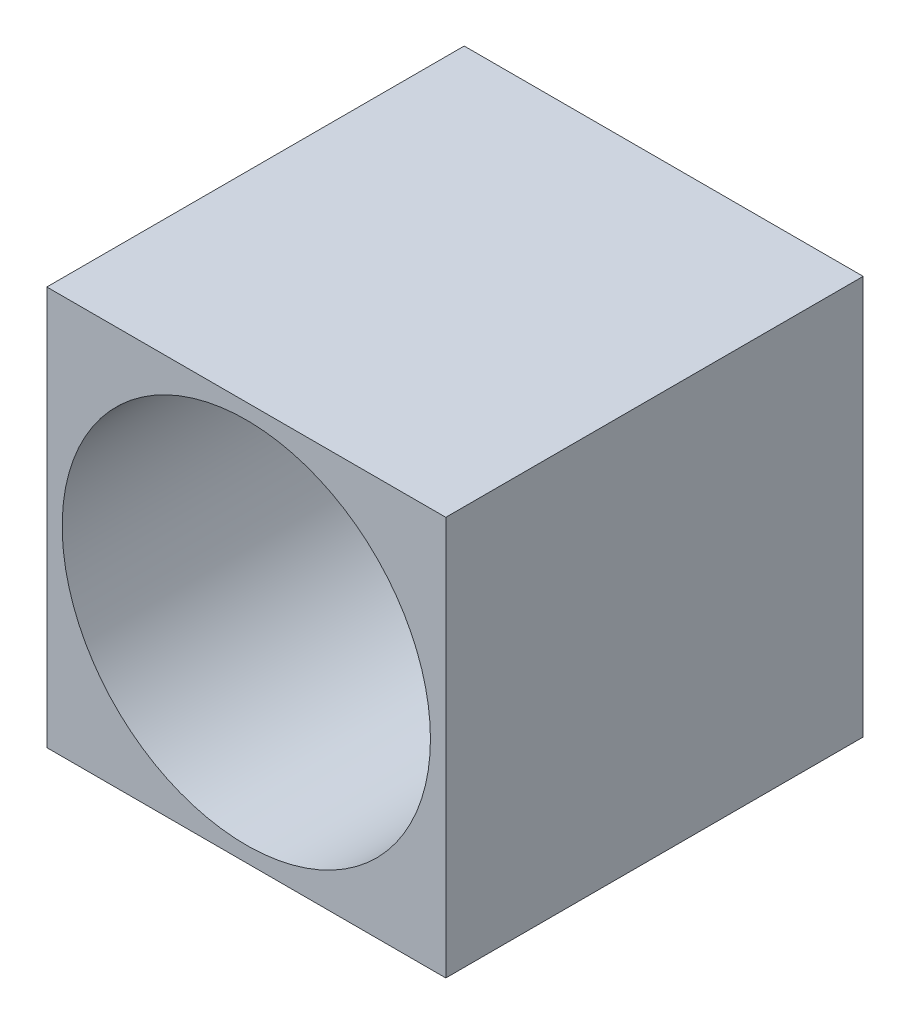
ISO-10303-21;
HEADER;
FILE_DESCRIPTION(('STEP AP214'),'2;1');
FILE_NAME('part.step','',(''),(''),'','','');
FILE_SCHEMA(('AUTOMOTIVE_DESIGN { 1 0 10303 214 1 1 1 1 }'));
ENDSEC;
DATA;
#1=APPLICATION_CONTEXT('core data for automotive mechanical design processes');
#2=APPLICATION_PROTOCOL_DEFINITION('international standard','automotive_design',2000,#1);
#3=PRODUCT_CONTEXT('',#1,'mechanical');
#4=PRODUCT('Part','Part','',(#3));
#5=PRODUCT_RELATED_PRODUCT_CATEGORY('part','',(#4));
#6=PRODUCT_DEFINITION_FORMATION('','',#4);
#7=PRODUCT_DEFINITION_CONTEXT('part definition',#1,'design');
#8=PRODUCT_DEFINITION('design','',#6,#7);
#9=PRODUCT_DEFINITION_SHAPE('','',#8);
#10=(LENGTH_UNIT() NAMED_UNIT(*) SI_UNIT(.MILLI.,.METRE.));
#11=(NAMED_UNIT(*) PLANE_ANGLE_UNIT() SI_UNIT($,.RADIAN.));
#12=(NAMED_UNIT(*) SI_UNIT($,.STERADIAN.) SOLID_ANGLE_UNIT());
#13=UNCERTAINTY_MEASURE_WITH_UNIT(LENGTH_MEASURE(1.E-05),#10,'distance_accuracy_value','');
#14=(GEOMETRIC_REPRESENTATION_CONTEXT(3) GLOBAL_UNCERTAINTY_ASSIGNED_CONTEXT((#13)) GLOBAL_UNIT_ASSIGNED_CONTEXT((#10,
#11,#12)) REPRESENTATION_CONTEXT('',''));
#15=CARTESIAN_POINT('',(0.,0.,0.));
#16=DIRECTION('',(0.,0.,1.));
#17=DIRECTION('',(1.,0.,0.));
#18=AXIS2_PLACEMENT_3D('',#15,#16,#17);
#19=CARTESIAN_POINT('',(-1.625,1.625,3.4));
#20=DIRECTION('',(0.,1.,0.));
#21=DIRECTION('',(0.,0.,1.));
#22=AXIS2_PLACEMENT_3D('',#19,#20,#21);
#23=PLANE('',#22);
#24=DIRECTION('',(1.,0.,0.));
#25=VECTOR('',#24,1.);
#26=CARTESIAN_POINT('',(-1.625,1.625,0.));
#27=LINE('',#26,#25);
#28=CARTESIAN_POINT('',(-1.625,1.625,0.));
#29=VERTEX_POINT('',#28);
#30=CARTESIAN_POINT('',(1.625,1.625,0.));
#31=VERTEX_POINT('',#30);
#32=EDGE_CURVE('E98',#29,#31,#27,.T.);
#33=ORIENTED_EDGE('',*,*,#32,.F.);
#34=DIRECTION('',(0.,0.,-1.));
#35=VECTOR('',#34,1.);
#36=CARTESIAN_POINT('',(-1.625,1.625,3.4));
#37=LINE('',#36,#35);
#38=CARTESIAN_POINT('',(-1.625,1.625,3.4));
#39=VERTEX_POINT('',#38);
#40=EDGE_CURVE('E11',#39,#29,#37,.T.);
#41=ORIENTED_EDGE('',*,*,#40,.F.);
#42=DIRECTION('',(1.,0.,0.));
#43=VECTOR('',#42,1.);
#44=CARTESIAN_POINT('',(-1.625,1.625,3.4));
#45=LINE('',#44,#43);
#46=CARTESIAN_POINT('',(1.625,1.625,3.4));
#47=VERTEX_POINT('',#46);
#48=EDGE_CURVE('E91',#39,#47,#45,.T.);
#49=ORIENTED_EDGE('',*,*,#48,.T.);
#50=DIRECTION('',(0.,0.,-1.));
#51=VECTOR('',#50,1.);
#52=CARTESIAN_POINT('',(1.625,1.625,3.4));
#53=LINE('',#52,#51);
#54=EDGE_CURVE('E36',#47,#31,#53,.T.);
#55=ORIENTED_EDGE('',*,*,#54,.T.);
#56=EDGE_LOOP('',(#33,#41,#49,#55));
#57=FACE_BOUND('',#56,.T.);
#58=ADVANCED_FACE('F33',(#57),#23,.T.);
#59=CARTESIAN_POINT('',(-1.625,-1.625,3.4));
#60=DIRECTION('',(-1.,0.,0.));
#61=DIRECTION('',(0.,0.,1.));
#62=AXIS2_PLACEMENT_3D('',#59,#60,#61);
#63=PLANE('',#62);
#64=DIRECTION('',(0.,1.,0.));
#65=VECTOR('',#64,1.);
#66=CARTESIAN_POINT('',(-1.625,-1.625,0.));
#67=LINE('',#66,#65);
#68=CARTESIAN_POINT('',(-1.625,-1.625,0.));
#69=VERTEX_POINT('',#68);
#70=EDGE_CURVE('E93',#69,#29,#67,.T.);
#71=ORIENTED_EDGE('',*,*,#70,.F.);
#72=DIRECTION('',(0.,0.,-1.));
#73=VECTOR('',#72,1.);
#74=CARTESIAN_POINT('',(-1.625,-1.625,3.4));
#75=LINE('',#74,#73);
#76=CARTESIAN_POINT('',(-1.625,-1.625,3.4));
#77=VERTEX_POINT('',#76);
#78=EDGE_CURVE('E42',#77,#69,#75,.T.);
#79=ORIENTED_EDGE('',*,*,#78,.F.);
#80=DIRECTION('',(0.,1.,0.));
#81=VECTOR('',#80,1.);
#82=CARTESIAN_POINT('',(-1.625,-1.625,3.4));
#83=LINE('',#82,#81);
#84=EDGE_CURVE('E88',#77,#39,#83,.T.);
#85=ORIENTED_EDGE('',*,*,#84,.T.);
#86=ORIENTED_EDGE('',*,*,#40,.T.);
#87=EDGE_LOOP('',(#71,#79,#85,#86));
#88=FACE_BOUND('',#87,.T.);
#89=ADVANCED_FACE('F109',(#88),#63,.T.);
#90=CARTESIAN_POINT('',(1.625,-1.625,3.4));
#91=DIRECTION('',(0.,-1.,0.));
#92=DIRECTION('',(0.,0.,-1.));
#93=AXIS2_PLACEMENT_3D('',#90,#91,#92);
#94=PLANE('',#93);
#95=DIRECTION('',(-1.,0.,0.));
#96=VECTOR('',#95,1.);
#97=CARTESIAN_POINT('',(1.625,-1.625,0.));
#98=LINE('',#97,#96);
#99=CARTESIAN_POINT('',(1.625,-1.625,0.));
#100=VERTEX_POINT('',#99);
#101=EDGE_CURVE('E83',#100,#69,#98,.T.);
#102=ORIENTED_EDGE('',*,*,#101,.F.);
#103=DIRECTION('',(0.,0.,-1.));
#104=VECTOR('',#103,1.);
#105=CARTESIAN_POINT('',(1.625,-1.625,3.4));
#106=LINE('',#105,#104);
#107=CARTESIAN_POINT('',(1.625,-1.625,3.4));
#108=VERTEX_POINT('',#107);
#109=EDGE_CURVE('E78',#108,#100,#106,.T.);
#110=ORIENTED_EDGE('',*,*,#109,.F.);
#111=DIRECTION('',(-1.,0.,0.));
#112=VECTOR('',#111,1.);
#113=CARTESIAN_POINT('',(1.625,-1.625,3.4));
#114=LINE('',#113,#112);
#115=EDGE_CURVE('E81',#108,#77,#114,.T.);
#116=ORIENTED_EDGE('',*,*,#115,.T.);
#117=ORIENTED_EDGE('',*,*,#78,.T.);
#118=EDGE_LOOP('',(#102,#110,#116,#117));
#119=FACE_BOUND('',#118,.T.);
#120=ADVANCED_FACE('F80',(#119),#94,.T.);
#121=CARTESIAN_POINT('',(1.625,1.625,3.4));
#122=DIRECTION('',(1.,0.,0.));
#123=DIRECTION('',(0.,0.,-1.));
#124=AXIS2_PLACEMENT_3D('',#121,#122,#123);
#125=PLANE('',#124);
#126=DIRECTION('',(0.,-1.,0.));
#127=VECTOR('',#126,1.);
#128=CARTESIAN_POINT('',(1.625,1.625,0.));
#129=LINE('',#128,#127);
#130=EDGE_CURVE('E101',#31,#100,#129,.T.);
#131=ORIENTED_EDGE('',*,*,#130,.F.);
#132=ORIENTED_EDGE('',*,*,#54,.F.);
#133=DIRECTION('',(0.,-1.,0.));
#134=VECTOR('',#133,1.);
#135=CARTESIAN_POINT('',(1.625,1.625,3.4));
#136=LINE('',#135,#134);
#137=EDGE_CURVE('E87',#47,#108,#136,.T.);
#138=ORIENTED_EDGE('',*,*,#137,.T.);
#139=ORIENTED_EDGE('',*,*,#109,.T.);
#140=EDGE_LOOP('',(#131,#132,#138,#139));
#141=FACE_BOUND('',#140,.T.);
#142=ADVANCED_FACE('F90',(#141),#125,.T.);
#143=CARTESIAN_POINT('',(0.,0.,3.4));
#144=DIRECTION('',(0.,0.,-1.));
#145=DIRECTION('',(-1.,0.,0.));
#146=AXIS2_PLACEMENT_3D('',#143,#144,#145);
#147=PLANE('',#146);
#148=CARTESIAN_POINT('',(0.,0.,3.4));
#149=DIRECTION('',(0.,0.,-1.));
#150=DIRECTION('',(1.,0.,0.));
#151=AXIS2_PLACEMENT_3D('',#148,#149,#150);
#152=CIRCLE('',#151,1.5);
#153=CARTESIAN_POINT('',(1.5,0.,3.4));
#154=VERTEX_POINT('',#153);
#155=EDGE_CURVE('E102',#154,#154,#152,.T.);
#156=ORIENTED_EDGE('',*,*,#155,.T.);
#157=EDGE_LOOP('',(#156));
#158=FACE_BOUND('',#157,.T.);
#159=ORIENTED_EDGE('',*,*,#48,.F.);
#160=ORIENTED_EDGE('',*,*,#84,.F.);
#161=ORIENTED_EDGE('',*,*,#115,.F.);
#162=ORIENTED_EDGE('',*,*,#137,.F.);
#163=EDGE_LOOP('',(#159,#160,#161,#162));
#164=FACE_BOUND('',#163,.T.);
#165=ADVANCED_FACE('F86',(#158,#164),#147,.F.);
#166=CARTESIAN_POINT('',(0.,0.,0.));
#167=DIRECTION('',(0.,0.,-1.));
#168=DIRECTION('',(-1.,0.,0.));
#169=AXIS2_PLACEMENT_3D('',#166,#167,#168);
#170=PLANE('',#169);
#171=CARTESIAN_POINT('',(0.,0.,0.));
#172=DIRECTION('',(0.,0.,-1.));
#173=DIRECTION('',(1.,0.,0.));
#174=AXIS2_PLACEMENT_3D('',#171,#172,#173);
#175=CIRCLE('',#174,1.5);
#176=CARTESIAN_POINT('',(1.5,0.,0.));
#177=VERTEX_POINT('',#176);
#178=EDGE_CURVE('E139',#177,#177,#175,.T.);
#179=ORIENTED_EDGE('',*,*,#178,.F.);
#180=EDGE_LOOP('',(#179));
#181=FACE_BOUND('',#180,.T.);
#182=ORIENTED_EDGE('',*,*,#32,.T.);
#183=ORIENTED_EDGE('',*,*,#130,.T.);
#184=ORIENTED_EDGE('',*,*,#101,.T.);
#185=ORIENTED_EDGE('',*,*,#70,.T.);
#186=EDGE_LOOP('',(#182,#183,#184,#185));
#187=FACE_BOUND('',#186,.T.);
#188=ADVANCED_FACE('F108',(#181,#187),#170,.T.);
#189=CARTESIAN_POINT('',(0.,0.,3.4));
#190=DIRECTION('',(0.,0.,-1.));
#191=DIRECTION('',(-1.,0.,0.));
#192=AXIS2_PLACEMENT_3D('',#189,#190,#191);
#193=CYLINDRICAL_SURFACE('',#192,1.5);
#194=ORIENTED_EDGE('',*,*,#155,.F.);
#195=EDGE_LOOP('',(#194));
#196=FACE_BOUND('',#195,.T.);
#197=ORIENTED_EDGE('',*,*,#178,.T.);
#198=EDGE_LOOP('',(#197));
#199=FACE_BOUND('',#198,.T.);
#200=ADVANCED_FACE('F127',(#196,#199),#193,.F.);
#201=CLOSED_SHELL('',(#58,#89,#120,#142,#165,#188,#200));
#202=MANIFOLD_SOLID_BREP('B2',#201);
#203=ADVANCED_BREP_SHAPE_REPRESENTATION('',(#18,#202),#14);
#204=SHAPE_DEFINITION_REPRESENTATION(#9,#203);
ENDSEC;
END-ISO-10303-21;
